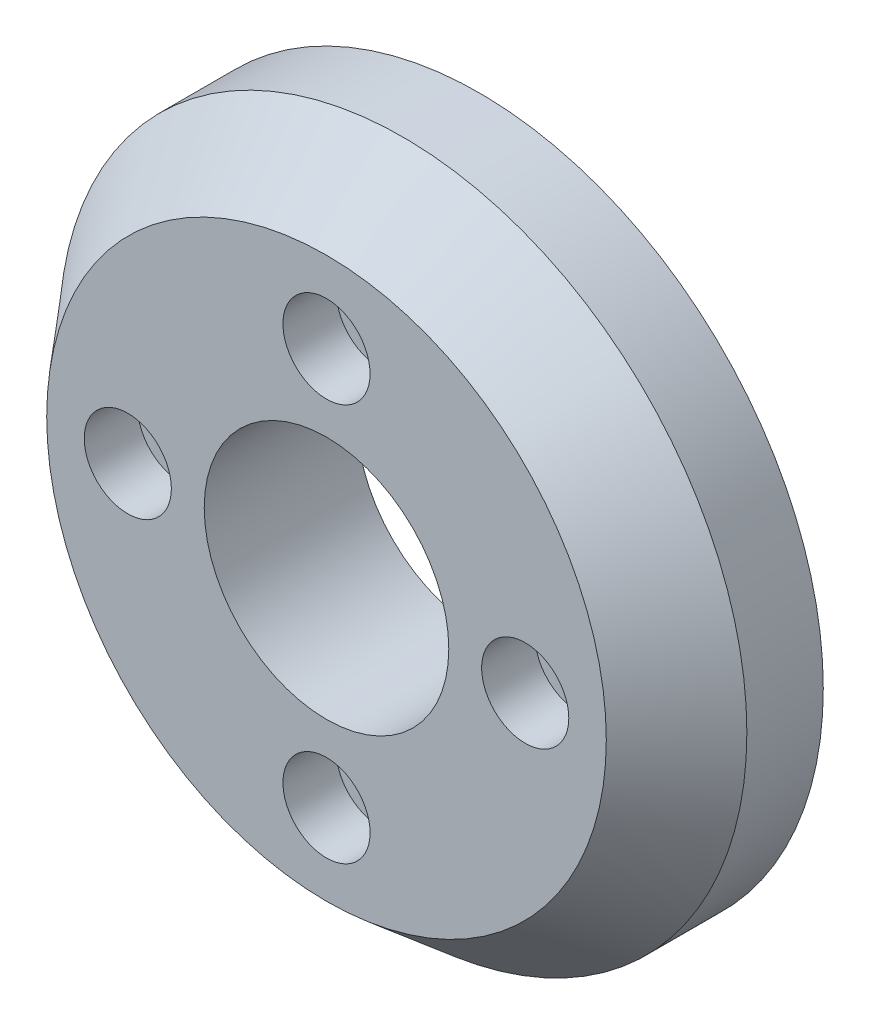
ISO-10303-21;
HEADER;
FILE_DESCRIPTION(('STEP AP214'),'2;1');
FILE_NAME('part.step','',(''),(''),'','','');
FILE_SCHEMA(('AUTOMOTIVE_DESIGN { 1 0 10303 214 1 1 1 1 }'));
ENDSEC;
DATA;
#1=APPLICATION_CONTEXT('core data for automotive mechanical design processes');
#2=APPLICATION_PROTOCOL_DEFINITION('international standard','automotive_design',2000,#1);
#3=PRODUCT_CONTEXT('',#1,'mechanical');
#4=PRODUCT('Part','Part','',(#3));
#5=PRODUCT_RELATED_PRODUCT_CATEGORY('part','',(#4));
#6=PRODUCT_DEFINITION_FORMATION('','',#4);
#7=PRODUCT_DEFINITION_CONTEXT('part definition',#1,'design');
#8=PRODUCT_DEFINITION('design','',#6,#7);
#9=PRODUCT_DEFINITION_SHAPE('','',#8);
#10=(LENGTH_UNIT() NAMED_UNIT(*) SI_UNIT(.MILLI.,.METRE.));
#11=(NAMED_UNIT(*) PLANE_ANGLE_UNIT() SI_UNIT($,.RADIAN.));
#12=(NAMED_UNIT(*) SI_UNIT($,.STERADIAN.) SOLID_ANGLE_UNIT());
#13=UNCERTAINTY_MEASURE_WITH_UNIT(LENGTH_MEASURE(1.E-05),#10,'distance_accuracy_value','');
#14=(GEOMETRIC_REPRESENTATION_CONTEXT(3) GLOBAL_UNCERTAINTY_ASSIGNED_CONTEXT((#13)) GLOBAL_UNIT_ASSIGNED_CONTEXT((#10,
#11,#12)) REPRESENTATION_CONTEXT('',''));
#15=CARTESIAN_POINT('',(0.,0.,0.));
#16=DIRECTION('',(0.,0.,1.));
#17=DIRECTION('',(1.,0.,0.));
#18=AXIS2_PLACEMENT_3D('',#15,#16,#17);
#19=CARTESIAN_POINT('',(-13.,0.,10.));
#20=DIRECTION('',(0.,0.,-1.));
#21=DIRECTION('',(-1.,0.,0.));
#22=AXIS2_PLACEMENT_3D('',#19,#20,#21);
#23=CYLINDRICAL_SURFACE('',#22,2.85);
#24=CARTESIAN_POINT('',(-13.,0.,6.5));
#25=DIRECTION('',(0.,0.,1.));
#26=DIRECTION('',(1.,0.,0.));
#27=AXIS2_PLACEMENT_3D('',#24,#25,#26);
#28=CIRCLE('',#27,2.85);
#29=CARTESIAN_POINT('',(-10.15,0.,6.5));
#30=VERTEX_POINT('',#29);
#31=EDGE_CURVE('E54',#30,#30,#28,.T.);
#32=ORIENTED_EDGE('',*,*,#31,.F.);
#33=EDGE_LOOP('',(#32));
#34=FACE_BOUND('',#33,.T.);
#35=CARTESIAN_POINT('',(-13.,0.,10.));
#36=DIRECTION('',(0.,0.,1.));
#37=DIRECTION('',(1.,0.,0.));
#38=AXIS2_PLACEMENT_3D('',#35,#36,#37);
#39=CIRCLE('',#38,2.85);
#40=CARTESIAN_POINT('',(-10.15,0.,10.));
#41=VERTEX_POINT('',#40);
#42=EDGE_CURVE('E69',#41,#41,#39,.T.);
#43=ORIENTED_EDGE('',*,*,#42,.T.);
#44=EDGE_LOOP('',(#43));
#45=FACE_BOUND('',#44,.T.);
#46=ADVANCED_FACE('F42',(#34,#45),#23,.F.);
#47=CARTESIAN_POINT('',(0.,13.,10.));
#48=DIRECTION('',(0.,0.,-1.));
#49=DIRECTION('',(-1.,0.,0.));
#50=AXIS2_PLACEMENT_3D('',#47,#48,#49);
#51=CYLINDRICAL_SURFACE('',#50,2.85);
#52=CARTESIAN_POINT('',(0.,13.,6.5));
#53=DIRECTION('',(0.,0.,1.));
#54=DIRECTION('',(1.,0.,0.));
#55=AXIS2_PLACEMENT_3D('',#52,#53,#54);
#56=CIRCLE('',#55,2.85);
#57=CARTESIAN_POINT('',(2.85000000000005,13.,6.5));
#58=VERTEX_POINT('',#57);
#59=EDGE_CURVE('E58',#58,#58,#56,.T.);
#60=ORIENTED_EDGE('',*,*,#59,.F.);
#61=EDGE_LOOP('',(#60));
#62=FACE_BOUND('',#61,.T.);
#63=CARTESIAN_POINT('',(0.,13.,10.));
#64=DIRECTION('',(0.,0.,1.));
#65=DIRECTION('',(1.,0.,0.));
#66=AXIS2_PLACEMENT_3D('',#63,#64,#65);
#67=CIRCLE('',#66,2.85);
#68=CARTESIAN_POINT('',(2.85000000000005,13.,10.));
#69=VERTEX_POINT('',#68);
#70=EDGE_CURVE('E77',#69,#69,#67,.T.);
#71=ORIENTED_EDGE('',*,*,#70,.T.);
#72=EDGE_LOOP('',(#71));
#73=FACE_BOUND('',#72,.T.);
#74=ADVANCED_FACE('F130',(#62,#73),#51,.F.);
#75=CARTESIAN_POINT('',(13.,0.,10.));
#76=DIRECTION('',(0.,0.,-1.));
#77=DIRECTION('',(-1.,0.,0.));
#78=AXIS2_PLACEMENT_3D('',#75,#76,#77);
#79=CYLINDRICAL_SURFACE('',#78,2.85);
#80=CARTESIAN_POINT('',(13.,0.,6.5));
#81=DIRECTION('',(0.,0.,1.));
#82=DIRECTION('',(1.,0.,0.));
#83=AXIS2_PLACEMENT_3D('',#80,#81,#82);
#84=CIRCLE('',#83,2.85);
#85=CARTESIAN_POINT('',(15.85,0.,6.5));
#86=VERTEX_POINT('',#85);
#87=EDGE_CURVE('E63',#86,#86,#84,.T.);
#88=ORIENTED_EDGE('',*,*,#87,.F.);
#89=EDGE_LOOP('',(#88));
#90=FACE_BOUND('',#89,.T.);
#91=CARTESIAN_POINT('',(13.,0.,10.));
#92=DIRECTION('',(0.,0.,1.));
#93=DIRECTION('',(1.,0.,0.));
#94=AXIS2_PLACEMENT_3D('',#91,#92,#93);
#95=CIRCLE('',#94,2.85);
#96=CARTESIAN_POINT('',(15.85,0.,10.));
#97=VERTEX_POINT('',#96);
#98=EDGE_CURVE('E80',#97,#97,#95,.T.);
#99=ORIENTED_EDGE('',*,*,#98,.T.);
#100=EDGE_LOOP('',(#99));
#101=FACE_BOUND('',#100,.T.);
#102=ADVANCED_FACE('F136',(#90,#101),#79,.F.);
#103=CARTESIAN_POINT('',(-1.36167772214882E-13,-13.,10.));
#104=DIRECTION('',(0.,0.,-1.));
#105=DIRECTION('',(-1.,0.,0.));
#106=AXIS2_PLACEMENT_3D('',#103,#104,#105);
#107=CYLINDRICAL_SURFACE('',#106,2.85);
#108=CARTESIAN_POINT('',(-1.36167772214882E-13,-13.,6.5));
#109=DIRECTION('',(0.,0.,1.));
#110=DIRECTION('',(1.,0.,0.));
#111=AXIS2_PLACEMENT_3D('',#108,#109,#110);
#112=CIRCLE('',#111,2.85);
#113=CARTESIAN_POINT('',(2.84999999999986,-13.,6.5));
#114=VERTEX_POINT('',#113);
#115=EDGE_CURVE('E66',#114,#114,#112,.T.);
#116=ORIENTED_EDGE('',*,*,#115,.F.);
#117=EDGE_LOOP('',(#116));
#118=FACE_BOUND('',#117,.T.);
#119=CARTESIAN_POINT('',(-1.36167772214882E-13,-13.,10.));
#120=DIRECTION('',(0.,0.,1.));
#121=DIRECTION('',(1.,0.,0.));
#122=AXIS2_PLACEMENT_3D('',#119,#120,#121);
#123=CIRCLE('',#122,2.85);
#124=CARTESIAN_POINT('',(2.84999999999986,-13.,10.));
#125=VERTEX_POINT('',#124);
#126=EDGE_CURVE('E73',#125,#125,#123,.T.);
#127=ORIENTED_EDGE('',*,*,#126,.T.);
#128=EDGE_LOOP('',(#127));
#129=FACE_BOUND('',#128,.T.);
#130=ADVANCED_FACE('F146',(#118,#129),#107,.F.);
#131=CARTESIAN_POINT('',(0.,0.,10.));
#132=DIRECTION('',(0.,0.,-1.));
#133=DIRECTION('',(-1.,0.,0.));
#134=AXIS2_PLACEMENT_3D('',#131,#132,#133);
#135=CYLINDRICAL_SURFACE('',#134,22.5);
#136=CARTESIAN_POINT('',(0.,0.,4.99999999999997));
#137=DIRECTION('',(0.,0.,1.));
#138=DIRECTION('',(1.,0.,0.));
#139=AXIS2_PLACEMENT_3D('',#136,#137,#138);
#140=CIRCLE('',#139,22.5);
#141=CARTESIAN_POINT('',(22.5,0.,4.99999999999997));
#142=VERTEX_POINT('',#141);
#143=EDGE_CURVE('E11',#142,#142,#140,.F.);
#144=ORIENTED_EDGE('',*,*,#143,.T.);
#145=EDGE_LOOP('',(#144));
#146=FACE_BOUND('',#145,.T.);
#147=CARTESIAN_POINT('',(0.,0.,0.));
#148=DIRECTION('',(0.,0.,1.));
#149=DIRECTION('',(1.,0.,0.));
#150=AXIS2_PLACEMENT_3D('',#147,#148,#149);
#151=CIRCLE('',#150,22.5);
#152=CARTESIAN_POINT('',(22.5,0.,0.));
#153=VERTEX_POINT('',#152);
#154=EDGE_CURVE('E70',#153,#153,#151,.T.);
#155=ORIENTED_EDGE('',*,*,#154,.T.);
#156=EDGE_LOOP('',(#155));
#157=FACE_BOUND('',#156,.T.);
#158=ADVANCED_FACE('F142',(#146,#157),#135,.T.);
#159=CARTESIAN_POINT('',(0.,0.,10.));
#160=DIRECTION('',(0.,0.,1.));
#161=DIRECTION('',(1.,0.,0.));
#162=AXIS2_PLACEMENT_3D('',#159,#160,#161);
#163=PLANE('',#162);
#164=CARTESIAN_POINT('',(0.,0.,10.));
#165=DIRECTION('',(0.,0.,1.));
#166=DIRECTION('',(1.,0.,0.));
#167=AXIS2_PLACEMENT_3D('',#164,#165,#166);
#168=CIRCLE('',#167,8.);
#169=CARTESIAN_POINT('',(8.,0.,10.));
#170=VERTEX_POINT('',#169);
#171=EDGE_CURVE('E89',#170,#170,#168,.T.);
#172=ORIENTED_EDGE('',*,*,#171,.F.);
#173=EDGE_LOOP('',(#172));
#174=FACE_BOUND('',#173,.T.);
#175=CARTESIAN_POINT('',(0.,0.,10.));
#176=DIRECTION('',(0.,0.,1.));
#177=DIRECTION('',(1.,0.,0.));
#178=AXIS2_PLACEMENT_3D('',#175,#176,#177);
#179=CIRCLE('',#178,18.3045018441136);
#180=CARTESIAN_POINT('',(18.3045018441136,0.,10.));
#181=VERTEX_POINT('',#180);
#182=EDGE_CURVE('E50',#181,#181,#179,.T.);
#183=ORIENTED_EDGE('',*,*,#182,.T.);
#184=EDGE_LOOP('',(#183));
#185=FACE_BOUND('',#184,.T.);
#186=ORIENTED_EDGE('',*,*,#126,.F.);
#187=EDGE_LOOP('',(#186));
#188=FACE_BOUND('',#187,.T.);
#189=ORIENTED_EDGE('',*,*,#98,.F.);
#190=EDGE_LOOP('',(#189));
#191=FACE_BOUND('',#190,.T.);
#192=ORIENTED_EDGE('',*,*,#70,.F.);
#193=EDGE_LOOP('',(#192));
#194=FACE_BOUND('',#193,.T.);
#195=ORIENTED_EDGE('',*,*,#42,.F.);
#196=EDGE_LOOP('',(#195));
#197=FACE_BOUND('',#196,.T.);
#198=ADVANCED_FACE('F154',(#174,#185,#188,#191,#194,#197),#163,.T.);
#199=CARTESIAN_POINT('',(0.,0.,0.));
#200=DIRECTION('',(0.,0.,1.));
#201=DIRECTION('',(1.,0.,0.));
#202=AXIS2_PLACEMENT_3D('',#199,#200,#201);
#203=PLANE('',#202);
#204=CARTESIAN_POINT('',(0.,0.,0.));
#205=DIRECTION('',(0.,0.,1.));
#206=DIRECTION('',(1.,0.,0.));
#207=AXIS2_PLACEMENT_3D('',#204,#205,#206);
#208=CIRCLE('',#207,8.);
#209=CARTESIAN_POINT('',(8.,0.,0.));
#210=VERTEX_POINT('',#209);
#211=EDGE_CURVE('E111',#210,#210,#208,.T.);
#212=ORIENTED_EDGE('',*,*,#211,.T.);
#213=EDGE_LOOP('',(#212));
#214=FACE_BOUND('',#213,.T.);
#215=ORIENTED_EDGE('',*,*,#154,.F.);
#216=EDGE_LOOP('',(#215));
#217=FACE_BOUND('',#216,.T.);
#218=CARTESIAN_POINT('',(13.,0.,0.));
#219=DIRECTION('',(0.,0.,1.));
#220=DIRECTION('',(1.,0.,0.));
#221=AXIS2_PLACEMENT_3D('',#218,#219,#220);
#222=CIRCLE('',#221,1.6);
#223=CARTESIAN_POINT('',(14.6,0.,0.));
#224=VERTEX_POINT('',#223);
#225=EDGE_CURVE('E88',#224,#224,#222,.T.);
#226=ORIENTED_EDGE('',*,*,#225,.T.);
#227=EDGE_LOOP('',(#226));
#228=FACE_BOUND('',#227,.T.);
#229=CARTESIAN_POINT('',(0.,13.,0.));
#230=DIRECTION('',(0.,0.,1.));
#231=DIRECTION('',(1.,0.,0.));
#232=AXIS2_PLACEMENT_3D('',#229,#230,#231);
#233=CIRCLE('',#232,1.6);
#234=CARTESIAN_POINT('',(1.60000000000005,13.,0.));
#235=VERTEX_POINT('',#234);
#236=EDGE_CURVE('E95',#235,#235,#233,.T.);
#237=ORIENTED_EDGE('',*,*,#236,.T.);
#238=EDGE_LOOP('',(#237));
#239=FACE_BOUND('',#238,.T.);
#240=CARTESIAN_POINT('',(-13.,0.,0.));
#241=DIRECTION('',(0.,0.,1.));
#242=DIRECTION('',(1.,0.,0.));
#243=AXIS2_PLACEMENT_3D('',#240,#241,#242);
#244=CIRCLE('',#243,1.6);
#245=CARTESIAN_POINT('',(-11.4,0.,0.));
#246=VERTEX_POINT('',#245);
#247=EDGE_CURVE('E101',#246,#246,#244,.T.);
#248=ORIENTED_EDGE('',*,*,#247,.T.);
#249=EDGE_LOOP('',(#248));
#250=FACE_BOUND('',#249,.T.);
#251=CARTESIAN_POINT('',(-1.36167772214882E-13,-13.,0.));
#252=DIRECTION('',(0.,0.,1.));
#253=DIRECTION('',(1.,0.,0.));
#254=AXIS2_PLACEMENT_3D('',#251,#252,#253);
#255=CIRCLE('',#254,1.6);
#256=CARTESIAN_POINT('',(1.59999999999986,-13.,0.));
#257=VERTEX_POINT('',#256);
#258=EDGE_CURVE('E74',#257,#257,#255,.T.);
#259=ORIENTED_EDGE('',*,*,#258,.T.);
#260=EDGE_LOOP('',(#259));
#261=FACE_BOUND('',#260,.T.);
#262=ADVANCED_FACE('F115',(#214,#217,#228,#239,#250,#261),#203,.F.);
#263=CARTESIAN_POINT('',(13.,0.,18.0610173055266));
#264=DIRECTION('',(0.,0.,-1.));
#265=DIRECTION('',(-1.,0.,0.));
#266=AXIS2_PLACEMENT_3D('',#263,#264,#265);
#267=CYLINDRICAL_SURFACE('',#266,1.6);
#268=ORIENTED_EDGE('',*,*,#225,.F.);
#269=EDGE_LOOP('',(#268));
#270=FACE_BOUND('',#269,.T.);
#271=CARTESIAN_POINT('',(13.,0.,6.5));
#272=DIRECTION('',(0.,0.,1.));
#273=DIRECTION('',(1.,0.,0.));
#274=AXIS2_PLACEMENT_3D('',#271,#272,#273);
#275=CIRCLE('',#274,1.6);
#276=CARTESIAN_POINT('',(14.6,0.,6.5));
#277=VERTEX_POINT('',#276);
#278=EDGE_CURVE('E85',#277,#277,#275,.T.);
#279=ORIENTED_EDGE('',*,*,#278,.T.);
#280=EDGE_LOOP('',(#279));
#281=FACE_BOUND('',#280,.T.);
#282=ADVANCED_FACE('F172',(#270,#281),#267,.F.);
#283=CARTESIAN_POINT('',(0.,0.,6.5));
#284=DIRECTION('',(0.,0.,1.));
#285=DIRECTION('',(1.,0.,0.));
#286=AXIS2_PLACEMENT_3D('',#283,#284,#285);
#287=PLANE('',#286);
#288=ORIENTED_EDGE('',*,*,#278,.F.);
#289=EDGE_LOOP('',(#288));
#290=FACE_BOUND('',#289,.T.);
#291=ORIENTED_EDGE('',*,*,#87,.T.);
#292=EDGE_LOOP('',(#291));
#293=FACE_BOUND('',#292,.T.);
#294=ADVANCED_FACE('F175',(#290,#293),#287,.T.);
#295=CARTESIAN_POINT('',(0.,13.,18.0610173055266));
#296=DIRECTION('',(0.,0.,-1.));
#297=DIRECTION('',(-1.,0.,0.));
#298=AXIS2_PLACEMENT_3D('',#295,#296,#297);
#299=CYLINDRICAL_SURFACE('',#298,1.6);
#300=ORIENTED_EDGE('',*,*,#236,.F.);
#301=EDGE_LOOP('',(#300));
#302=FACE_BOUND('',#301,.T.);
#303=CARTESIAN_POINT('',(0.,13.,6.5));
#304=DIRECTION('',(0.,0.,1.));
#305=DIRECTION('',(1.,0.,0.));
#306=AXIS2_PLACEMENT_3D('',#303,#304,#305);
#307=CIRCLE('',#306,1.6);
#308=CARTESIAN_POINT('',(1.60000000000005,13.,6.5));
#309=VERTEX_POINT('',#308);
#310=EDGE_CURVE('E92',#309,#309,#307,.T.);
#311=ORIENTED_EDGE('',*,*,#310,.T.);
#312=EDGE_LOOP('',(#311));
#313=FACE_BOUND('',#312,.T.);
#314=ADVANCED_FACE('F178',(#302,#313),#299,.F.);
#315=CARTESIAN_POINT('',(0.,0.,6.5));
#316=DIRECTION('',(0.,0.,1.));
#317=DIRECTION('',(1.,0.,0.));
#318=AXIS2_PLACEMENT_3D('',#315,#316,#317);
#319=PLANE('',#318);
#320=ORIENTED_EDGE('',*,*,#310,.F.);
#321=EDGE_LOOP('',(#320));
#322=FACE_BOUND('',#321,.T.);
#323=ORIENTED_EDGE('',*,*,#59,.T.);
#324=EDGE_LOOP('',(#323));
#325=FACE_BOUND('',#324,.T.);
#326=ADVANCED_FACE('F182',(#322,#325),#319,.T.);
#327=CARTESIAN_POINT('',(-13.,0.,18.0610173055266));
#328=DIRECTION('',(0.,0.,-1.));
#329=DIRECTION('',(-1.,0.,0.));
#330=AXIS2_PLACEMENT_3D('',#327,#328,#329);
#331=CYLINDRICAL_SURFACE('',#330,1.6);
#332=ORIENTED_EDGE('',*,*,#247,.F.);
#333=EDGE_LOOP('',(#332));
#334=FACE_BOUND('',#333,.T.);
#335=CARTESIAN_POINT('',(-13.,0.,6.5));
#336=DIRECTION('',(0.,0.,1.));
#337=DIRECTION('',(1.,0.,0.));
#338=AXIS2_PLACEMENT_3D('',#335,#336,#337);
#339=CIRCLE('',#338,1.6);
#340=CARTESIAN_POINT('',(-11.4,0.,6.5));
#341=VERTEX_POINT('',#340);
#342=EDGE_CURVE('E98',#341,#341,#339,.T.);
#343=ORIENTED_EDGE('',*,*,#342,.T.);
#344=EDGE_LOOP('',(#343));
#345=FACE_BOUND('',#344,.T.);
#346=ADVANCED_FACE('F185',(#334,#345),#331,.F.);
#347=CARTESIAN_POINT('',(0.,0.,6.5));
#348=DIRECTION('',(0.,0.,1.));
#349=DIRECTION('',(1.,0.,0.));
#350=AXIS2_PLACEMENT_3D('',#347,#348,#349);
#351=PLANE('',#350);
#352=ORIENTED_EDGE('',*,*,#342,.F.);
#353=EDGE_LOOP('',(#352));
#354=FACE_BOUND('',#353,.T.);
#355=ORIENTED_EDGE('',*,*,#31,.T.);
#356=EDGE_LOOP('',(#355));
#357=FACE_BOUND('',#356,.T.);
#358=ADVANCED_FACE('F190',(#354,#357),#351,.T.);
#359=CARTESIAN_POINT('',(-1.36167772214882E-13,-13.,18.0610173055266));
#360=DIRECTION('',(0.,0.,-1.));
#361=DIRECTION('',(-1.,0.,0.));
#362=AXIS2_PLACEMENT_3D('',#359,#360,#361);
#363=CYLINDRICAL_SURFACE('',#362,1.6);
#364=ORIENTED_EDGE('',*,*,#258,.F.);
#365=EDGE_LOOP('',(#364));
#366=FACE_BOUND('',#365,.T.);
#367=CARTESIAN_POINT('',(-1.36167772214882E-13,-13.,6.5));
#368=DIRECTION('',(0.,0.,1.));
#369=DIRECTION('',(1.,0.,0.));
#370=AXIS2_PLACEMENT_3D('',#367,#368,#369);
#371=CIRCLE('',#370,1.6);
#372=CARTESIAN_POINT('',(1.59999999999986,-13.,6.5));
#373=VERTEX_POINT('',#372);
#374=EDGE_CURVE('E104',#373,#373,#371,.T.);
#375=ORIENTED_EDGE('',*,*,#374,.T.);
#376=EDGE_LOOP('',(#375));
#377=FACE_BOUND('',#376,.T.);
#378=ADVANCED_FACE('F193',(#366,#377),#363,.F.);
#379=CARTESIAN_POINT('',(0.,0.,6.5));
#380=DIRECTION('',(0.,0.,1.));
#381=DIRECTION('',(1.,0.,0.));
#382=AXIS2_PLACEMENT_3D('',#379,#380,#381);
#383=PLANE('',#382);
#384=ORIENTED_EDGE('',*,*,#374,.F.);
#385=EDGE_LOOP('',(#384));
#386=FACE_BOUND('',#385,.T.);
#387=ORIENTED_EDGE('',*,*,#115,.T.);
#388=EDGE_LOOP('',(#387));
#389=FACE_BOUND('',#388,.T.);
#390=ADVANCED_FACE('F126',(#386,#389),#383,.T.);
#391=CARTESIAN_POINT('',(0.,0.,10.));
#392=DIRECTION('',(0.,0.,-1.));
#393=DIRECTION('',(-1.,0.,0.));
#394=AXIS2_PLACEMENT_3D('',#391,#392,#393);
#395=CONICAL_SURFACE('',#394,18.3045018441136,0.69813170079773);
#396=ORIENTED_EDGE('',*,*,#143,.F.);
#397=EDGE_LOOP('',(#396));
#398=FACE_BOUND('',#397,.T.);
#399=ORIENTED_EDGE('',*,*,#182,.F.);
#400=EDGE_LOOP('',(#399));
#401=FACE_BOUND('',#400,.T.);
#402=ADVANCED_FACE('F45',(#398,#401),#395,.T.);
#403=CARTESIAN_POINT('',(0.,0.,0.));
#404=DIRECTION('',(0.,0.,1.));
#405=DIRECTION('',(1.,0.,0.));
#406=AXIS2_PLACEMENT_3D('',#403,#404,#405);
#407=CYLINDRICAL_SURFACE('',#406,8.);
#408=ORIENTED_EDGE('',*,*,#171,.T.);
#409=EDGE_LOOP('',(#408));
#410=FACE_BOUND('',#409,.T.);
#411=ORIENTED_EDGE('',*,*,#211,.F.);
#412=EDGE_LOOP('',(#411));
#413=FACE_BOUND('',#412,.T.);
#414=ADVANCED_FACE('F118',(#410,#413),#407,.F.);
#415=CLOSED_SHELL('',(#46,#74,#102,#130,#158,#198,#262,#282,#294,#314,#326,#346,#358,#378,#390,
#402,#414));
#416=MANIFOLD_SOLID_BREP('B2',#415);
#417=ADVANCED_BREP_SHAPE_REPRESENTATION('',(#18,#416),#14);
#418=SHAPE_DEFINITION_REPRESENTATION(#9,#417);
ENDSEC;
END-ISO-10303-21;
